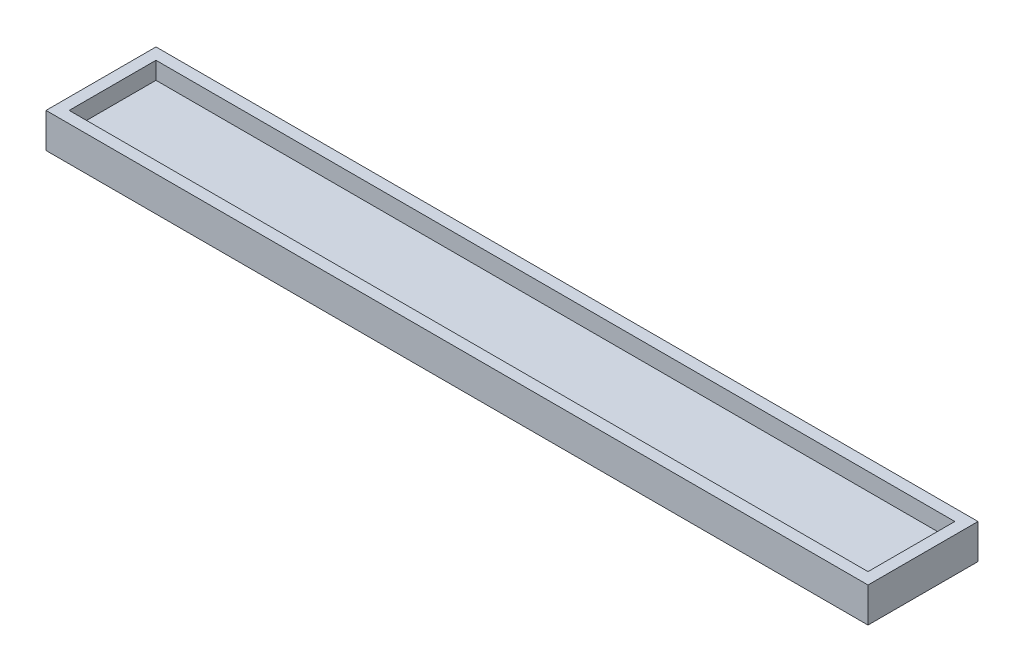
ISO-10303-21;
HEADER;
FILE_DESCRIPTION(('STEP AP214'),'2;1');
FILE_NAME('part.step','',(''),(''),'','','');
FILE_SCHEMA(('AUTOMOTIVE_DESIGN { 1 0 10303 214 1 1 1 1 }'));
ENDSEC;
DATA;
#1=APPLICATION_CONTEXT('core data for automotive mechanical design processes');
#2=APPLICATION_PROTOCOL_DEFINITION('international standard','automotive_design',2000,#1);
#3=PRODUCT_CONTEXT('',#1,'mechanical');
#4=PRODUCT('Part','Part','',(#3));
#5=PRODUCT_RELATED_PRODUCT_CATEGORY('part','',(#4));
#6=PRODUCT_DEFINITION_FORMATION('','',#4);
#7=PRODUCT_DEFINITION_CONTEXT('part definition',#1,'design');
#8=PRODUCT_DEFINITION('design','',#6,#7);
#9=PRODUCT_DEFINITION_SHAPE('','',#8);
#10=(LENGTH_UNIT() NAMED_UNIT(*) SI_UNIT(.MILLI.,.METRE.));
#11=(NAMED_UNIT(*) PLANE_ANGLE_UNIT() SI_UNIT($,.RADIAN.));
#12=(NAMED_UNIT(*) SI_UNIT($,.STERADIAN.) SOLID_ANGLE_UNIT());
#13=UNCERTAINTY_MEASURE_WITH_UNIT(LENGTH_MEASURE(1.E-05),#10,'distance_accuracy_value','');
#14=(GEOMETRIC_REPRESENTATION_CONTEXT(3) GLOBAL_UNCERTAINTY_ASSIGNED_CONTEXT((#13)) GLOBAL_UNIT_ASSIGNED_CONTEXT((#10,
#11,#12)) REPRESENTATION_CONTEXT('',''));
#15=CARTESIAN_POINT('',(0.,0.,0.));
#16=DIRECTION('',(0.,0.,1.));
#17=DIRECTION('',(1.,0.,0.));
#18=AXIS2_PLACEMENT_3D('',#15,#16,#17);
#19=CARTESIAN_POINT('',(0.,3.,0.));
#20=DIRECTION('',(0.,-1.,0.));
#21=DIRECTION('',(0.,0.,-1.));
#22=AXIS2_PLACEMENT_3D('',#19,#20,#21);
#23=PLANE('',#22);
#24=DIRECTION('',(0.,0.,1.));
#25=VECTOR('',#24,1.);
#26=CARTESIAN_POINT('',(0.,3.,0.));
#27=LINE('',#26,#25);
#28=CARTESIAN_POINT('',(0.,3.,-15.));
#29=VERTEX_POINT('',#28);
#30=CARTESIAN_POINT('',(0.,3.,0.));
#31=VERTEX_POINT('',#30);
#32=EDGE_CURVE('E160',#29,#31,#27,.T.);
#33=ORIENTED_EDGE('',*,*,#32,.T.);
#34=DIRECTION('',(1.,0.,0.));
#35=VECTOR('',#34,1.);
#36=CARTESIAN_POINT('',(0.,3.,0.));
#37=LINE('',#36,#35);
#38=CARTESIAN_POINT('',(138.,3.,0.));
#39=VERTEX_POINT('',#38);
#40=EDGE_CURVE('E164',#31,#39,#37,.T.);
#41=ORIENTED_EDGE('',*,*,#40,.T.);
#42=DIRECTION('',(0.,0.,-1.));
#43=VECTOR('',#42,1.);
#44=CARTESIAN_POINT('',(138.,3.,0.));
#45=LINE('',#44,#43);
#46=CARTESIAN_POINT('',(138.,3.,-15.));
#47=VERTEX_POINT('',#46);
#48=EDGE_CURVE('E50',#39,#47,#45,.T.);
#49=ORIENTED_EDGE('',*,*,#48,.T.);
#50=DIRECTION('',(-1.,0.,0.));
#51=VECTOR('',#50,1.);
#52=CARTESIAN_POINT('',(0.,3.,-15.));
#53=LINE('',#52,#51);
#54=EDGE_CURVE('E12',#47,#29,#53,.T.);
#55=ORIENTED_EDGE('',*,*,#54,.T.);
#56=EDGE_LOOP('',(#33,#41,#49,#55));
#57=FACE_BOUND('',#56,.T.);
#58=ADVANCED_FACE('F41',(#57),#23,.F.);
#59=CARTESIAN_POINT('',(0.,152.265487818944,-15.));
#60=DIRECTION('',(0.,0.,-1.));
#61=DIRECTION('',(-1.,0.,0.));
#62=AXIS2_PLACEMENT_3D('',#59,#60,#61);
#63=PLANE('',#62);
#64=DIRECTION('',(0.,-1.,0.));
#65=VECTOR('',#64,1.);
#66=CARTESIAN_POINT('',(0.,152.265487818944,-15.));
#67=LINE('',#66,#65);
#68=CARTESIAN_POINT('',(0.,6.00000000000001,-15.));
#69=VERTEX_POINT('',#68);
#70=EDGE_CURVE('E140',#69,#29,#67,.T.);
#71=ORIENTED_EDGE('',*,*,#70,.T.);
#72=ORIENTED_EDGE('',*,*,#54,.F.);
#73=DIRECTION('',(0.,-1.,0.));
#74=VECTOR('',#73,1.);
#75=CARTESIAN_POINT('',(138.,152.265487818944,-15.));
#76=LINE('',#75,#74);
#77=CARTESIAN_POINT('',(138.,6.00000000000001,-15.));
#78=VERTEX_POINT('',#77);
#79=EDGE_CURVE('E177',#78,#47,#76,.T.);
#80=ORIENTED_EDGE('',*,*,#79,.F.);
#81=DIRECTION('',(-1.,0.,0.));
#82=VECTOR('',#81,1.);
#83=CARTESIAN_POINT('',(0.,6.00000000000001,-15.));
#84=LINE('',#83,#82);
#85=EDGE_CURVE('E150',#78,#69,#84,.T.);
#86=ORIENTED_EDGE('',*,*,#85,.T.);
#87=EDGE_LOOP('',(#71,#72,#80,#86));
#88=FACE_BOUND('',#87,.T.);
#89=ADVANCED_FACE('F202',(#88),#63,.F.);
#90=CARTESIAN_POINT('',(138.,152.265487818944,0.));
#91=DIRECTION('',(1.,0.,0.));
#92=DIRECTION('',(0.,0.,-1.));
#93=AXIS2_PLACEMENT_3D('',#90,#91,#92);
#94=PLANE('',#93);
#95=ORIENTED_EDGE('',*,*,#79,.T.);
#96=ORIENTED_EDGE('',*,*,#48,.F.);
#97=DIRECTION('',(0.,-1.,0.));
#98=VECTOR('',#97,1.);
#99=CARTESIAN_POINT('',(138.,152.265487818944,0.));
#100=LINE('',#99,#98);
#101=CARTESIAN_POINT('',(138.,6.00000000000001,0.));
#102=VERTEX_POINT('',#101);
#103=EDGE_CURVE('E137',#102,#39,#100,.T.);
#104=ORIENTED_EDGE('',*,*,#103,.F.);
#105=DIRECTION('',(0.,0.,-1.));
#106=VECTOR('',#105,1.);
#107=CARTESIAN_POINT('',(138.,6.00000000000001,0.));
#108=LINE('',#107,#106);
#109=EDGE_CURVE('E195',#102,#78,#108,.T.);
#110=ORIENTED_EDGE('',*,*,#109,.T.);
#111=EDGE_LOOP('',(#95,#96,#104,#110));
#112=FACE_BOUND('',#111,.T.);
#113=ADVANCED_FACE('F174',(#112),#94,.F.);
#114=CARTESIAN_POINT('',(0.,152.265487818944,0.));
#115=DIRECTION('',(0.,0.,1.));
#116=DIRECTION('',(1.,0.,0.));
#117=AXIS2_PLACEMENT_3D('',#114,#115,#116);
#118=PLANE('',#117);
#119=ORIENTED_EDGE('',*,*,#103,.T.);
#120=ORIENTED_EDGE('',*,*,#40,.F.);
#121=DIRECTION('',(0.,-1.,0.));
#122=VECTOR('',#121,1.);
#123=CARTESIAN_POINT('',(0.,152.265487818944,0.));
#124=LINE('',#123,#122);
#125=CARTESIAN_POINT('',(0.,6.00000000000001,0.));
#126=VERTEX_POINT('',#125);
#127=EDGE_CURVE('E57',#126,#31,#124,.T.);
#128=ORIENTED_EDGE('',*,*,#127,.F.);
#129=DIRECTION('',(1.,0.,0.));
#130=VECTOR('',#129,1.);
#131=CARTESIAN_POINT('',(0.,6.00000000000001,0.));
#132=LINE('',#131,#130);
#133=EDGE_CURVE('E180',#126,#102,#132,.T.);
#134=ORIENTED_EDGE('',*,*,#133,.T.);
#135=EDGE_LOOP('',(#119,#120,#128,#134));
#136=FACE_BOUND('',#135,.T.);
#137=ADVANCED_FACE('F179',(#136),#118,.F.);
#138=CARTESIAN_POINT('',(0.,152.265487818944,0.));
#139=DIRECTION('',(-1.,0.,0.));
#140=DIRECTION('',(0.,0.,1.));
#141=AXIS2_PLACEMENT_3D('',#138,#139,#140);
#142=PLANE('',#141);
#143=ORIENTED_EDGE('',*,*,#127,.T.);
#144=ORIENTED_EDGE('',*,*,#32,.F.);
#145=ORIENTED_EDGE('',*,*,#70,.F.);
#146=DIRECTION('',(0.,0.,1.));
#147=VECTOR('',#146,1.);
#148=CARTESIAN_POINT('',(0.,6.00000000000001,0.));
#149=LINE('',#148,#147);
#150=EDGE_CURVE('E187',#69,#126,#149,.T.);
#151=ORIENTED_EDGE('',*,*,#150,.T.);
#152=EDGE_LOOP('',(#143,#144,#145,#151));
#153=FACE_BOUND('',#152,.T.);
#154=ADVANCED_FACE('F205',(#153),#142,.F.);
#155=CARTESIAN_POINT('',(-2.,152.265487818944,2.));
#156=DIRECTION('',(-1.,0.,0.));
#157=DIRECTION('',(0.,0.,1.));
#158=AXIS2_PLACEMENT_3D('',#155,#156,#157);
#159=PLANE('',#158);
#160=DIRECTION('',(0.,0.,1.));
#161=VECTOR('',#160,1.);
#162=CARTESIAN_POINT('',(-2.,6.00000000000001,2.));
#163=LINE('',#162,#161);
#164=CARTESIAN_POINT('',(-2.,6.00000000000001,-17.));
#165=VERTEX_POINT('',#164);
#166=CARTESIAN_POINT('',(-2.,6.00000000000001,2.));
#167=VERTEX_POINT('',#166);
#168=EDGE_CURVE('E165',#165,#167,#163,.T.);
#169=ORIENTED_EDGE('',*,*,#168,.F.);
#170=DIRECTION('',(0.,-1.,0.));
#171=VECTOR('',#170,1.);
#172=CARTESIAN_POINT('',(-2.,152.265487818944,-17.));
#173=LINE('',#172,#171);
#174=CARTESIAN_POINT('',(-2.,0.,-17.));
#175=VERTEX_POINT('',#174);
#176=EDGE_CURVE('E120',#165,#175,#173,.T.);
#177=ORIENTED_EDGE('',*,*,#176,.T.);
#178=DIRECTION('',(0.,0.,-1.));
#179=VECTOR('',#178,1.);
#180=CARTESIAN_POINT('',(-2.,0.,2.));
#181=LINE('',#180,#179);
#182=CARTESIAN_POINT('',(-2.,0.,2.));
#183=VERTEX_POINT('',#182);
#184=EDGE_CURVE('E124',#183,#175,#181,.T.);
#185=ORIENTED_EDGE('',*,*,#184,.F.);
#186=DIRECTION('',(0.,-1.,0.));
#187=VECTOR('',#186,1.);
#188=CARTESIAN_POINT('',(-2.,152.265487818944,2.));
#189=LINE('',#188,#187);
#190=EDGE_CURVE('E109',#167,#183,#189,.T.);
#191=ORIENTED_EDGE('',*,*,#190,.F.);
#192=EDGE_LOOP('',(#169,#177,#185,#191));
#193=FACE_BOUND('',#192,.T.);
#194=ADVANCED_FACE('F125',(#193),#159,.T.);
#195=CARTESIAN_POINT('',(-2.,152.265487818944,-17.));
#196=DIRECTION('',(0.,0.,-1.));
#197=DIRECTION('',(-1.,0.,0.));
#198=AXIS2_PLACEMENT_3D('',#195,#196,#197);
#199=PLANE('',#198);
#200=DIRECTION('',(-1.,0.,0.));
#201=VECTOR('',#200,1.);
#202=CARTESIAN_POINT('',(-2.,6.00000000000001,-17.));
#203=LINE('',#202,#201);
#204=CARTESIAN_POINT('',(140.,6.00000000000001,-17.));
#205=VERTEX_POINT('',#204);
#206=EDGE_CURVE('E159',#205,#165,#203,.T.);
#207=ORIENTED_EDGE('',*,*,#206,.F.);
#208=DIRECTION('',(0.,-1.,0.));
#209=VECTOR('',#208,1.);
#210=CARTESIAN_POINT('',(140.,152.265487818944,-17.));
#211=LINE('',#210,#209);
#212=CARTESIAN_POINT('',(140.,0.,-17.));
#213=VERTEX_POINT('',#212);
#214=EDGE_CURVE('E151',#205,#213,#211,.T.);
#215=ORIENTED_EDGE('',*,*,#214,.T.);
#216=DIRECTION('',(1.,0.,0.));
#217=VECTOR('',#216,1.);
#218=CARTESIAN_POINT('',(-2.,0.,-17.));
#219=LINE('',#218,#217);
#220=EDGE_CURVE('E131',#175,#213,#219,.T.);
#221=ORIENTED_EDGE('',*,*,#220,.F.);
#222=ORIENTED_EDGE('',*,*,#176,.F.);
#223=EDGE_LOOP('',(#207,#215,#221,#222));
#224=FACE_BOUND('',#223,.T.);
#225=ADVANCED_FACE('F213',(#224),#199,.T.);
#226=CARTESIAN_POINT('',(140.,152.265487818944,2.));
#227=DIRECTION('',(1.,0.,0.));
#228=DIRECTION('',(0.,0.,-1.));
#229=AXIS2_PLACEMENT_3D('',#226,#227,#228);
#230=PLANE('',#229);
#231=DIRECTION('',(0.,0.,-1.));
#232=VECTOR('',#231,1.);
#233=CARTESIAN_POINT('',(140.,6.00000000000001,2.));
#234=LINE('',#233,#232);
#235=CARTESIAN_POINT('',(140.,6.00000000000001,2.));
#236=VERTEX_POINT('',#235);
#237=EDGE_CURVE('E188',#236,#205,#234,.T.);
#238=ORIENTED_EDGE('',*,*,#237,.F.);
#239=DIRECTION('',(0.,-1.,0.));
#240=VECTOR('',#239,1.);
#241=CARTESIAN_POINT('',(140.,152.265487818944,2.));
#242=LINE('',#241,#240);
#243=CARTESIAN_POINT('',(140.,0.,2.));
#244=VERTEX_POINT('',#243);
#245=EDGE_CURVE('E147',#236,#244,#242,.T.);
#246=ORIENTED_EDGE('',*,*,#245,.T.);
#247=DIRECTION('',(0.,0.,1.));
#248=VECTOR('',#247,1.);
#249=CARTESIAN_POINT('',(140.,0.,2.));
#250=LINE('',#249,#248);
#251=EDGE_CURVE('E121',#213,#244,#250,.T.);
#252=ORIENTED_EDGE('',*,*,#251,.F.);
#253=ORIENTED_EDGE('',*,*,#214,.F.);
#254=EDGE_LOOP('',(#238,#246,#252,#253));
#255=FACE_BOUND('',#254,.T.);
#256=ADVANCED_FACE('F224',(#255),#230,.T.);
#257=CARTESIAN_POINT('',(-2.,152.265487818944,2.));
#258=DIRECTION('',(0.,0.,1.));
#259=DIRECTION('',(1.,0.,0.));
#260=AXIS2_PLACEMENT_3D('',#257,#258,#259);
#261=PLANE('',#260);
#262=DIRECTION('',(1.,0.,0.));
#263=VECTOR('',#262,1.);
#264=CARTESIAN_POINT('',(-2.,6.00000000000001,2.));
#265=LINE('',#264,#263);
#266=EDGE_CURVE('E116',#167,#236,#265,.T.);
#267=ORIENTED_EDGE('',*,*,#266,.F.);
#268=ORIENTED_EDGE('',*,*,#190,.T.);
#269=DIRECTION('',(-1.,0.,0.));
#270=VECTOR('',#269,1.);
#271=CARTESIAN_POINT('',(-2.,0.,2.));
#272=LINE('',#271,#270);
#273=EDGE_CURVE('E114',#244,#183,#272,.T.);
#274=ORIENTED_EDGE('',*,*,#273,.F.);
#275=ORIENTED_EDGE('',*,*,#245,.F.);
#276=EDGE_LOOP('',(#267,#268,#274,#275));
#277=FACE_BOUND('',#276,.T.);
#278=ADVANCED_FACE('F111',(#277),#261,.T.);
#279=CARTESIAN_POINT('',(0.,6.,0.));
#280=DIRECTION('',(0.,-1.,0.));
#281=DIRECTION('',(0.,0.,-1.));
#282=AXIS2_PLACEMENT_3D('',#279,#280,#281);
#283=PLANE('',#282);
#284=ORIENTED_EDGE('',*,*,#266,.T.);
#285=ORIENTED_EDGE('',*,*,#237,.T.);
#286=ORIENTED_EDGE('',*,*,#206,.T.);
#287=ORIENTED_EDGE('',*,*,#168,.T.);
#288=EDGE_LOOP('',(#284,#285,#286,#287));
#289=FACE_BOUND('',#288,.T.);
#290=ORIENTED_EDGE('',*,*,#85,.F.);
#291=ORIENTED_EDGE('',*,*,#109,.F.);
#292=ORIENTED_EDGE('',*,*,#133,.F.);
#293=ORIENTED_EDGE('',*,*,#150,.F.);
#294=EDGE_LOOP('',(#290,#291,#292,#293));
#295=FACE_BOUND('',#294,.T.);
#296=ADVANCED_FACE('F204',(#289,#295),#283,.F.);
#297=CARTESIAN_POINT('',(0.,0.,0.));
#298=DIRECTION('',(0.,-1.,0.));
#299=DIRECTION('',(0.,0.,-1.));
#300=AXIS2_PLACEMENT_3D('',#297,#298,#299);
#301=PLANE('',#300);
#302=ORIENTED_EDGE('',*,*,#273,.T.);
#303=ORIENTED_EDGE('',*,*,#184,.T.);
#304=ORIENTED_EDGE('',*,*,#220,.T.);
#305=ORIENTED_EDGE('',*,*,#251,.T.);
#306=EDGE_LOOP('',(#302,#303,#304,#305));
#307=FACE_BOUND('',#306,.T.);
#308=ADVANCED_FACE('F43',(#307),#301,.T.);
#309=CLOSED_SHELL('',(#58,#89,#113,#137,#154,#194,#225,#256,#278,#296,#308));
#310=MANIFOLD_SOLID_BREP('B2',#309);
#311=ADVANCED_BREP_SHAPE_REPRESENTATION('',(#18,#310),#14);
#312=SHAPE_DEFINITION_REPRESENTATION(#9,#311);
ENDSEC;
END-ISO-10303-21;
